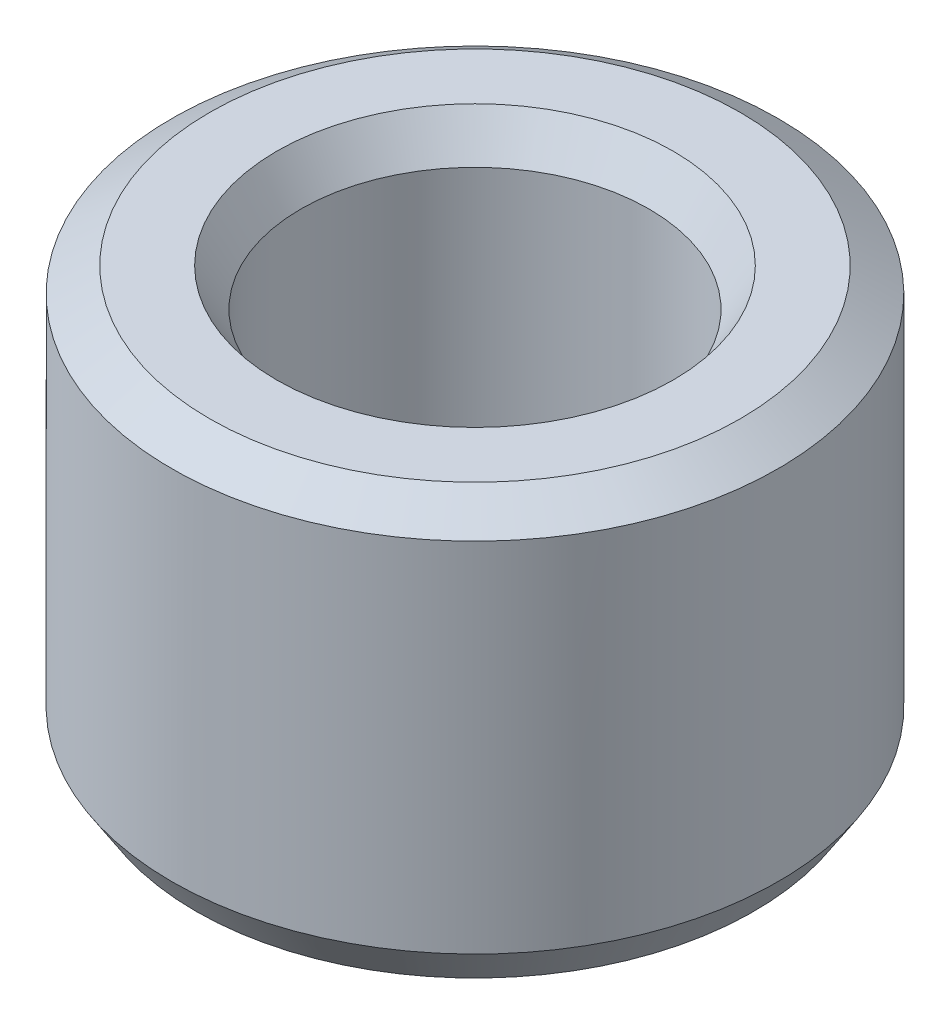
ISO-10303-21;
HEADER;
FILE_DESCRIPTION(('STEP AP214'),'2;1');
FILE_NAME('part.step','',(''),(''),'','','');
FILE_SCHEMA(('AUTOMOTIVE_DESIGN { 1 0 10303 214 1 1 1 1 }'));
ENDSEC;
DATA;
#1=APPLICATION_CONTEXT('core data for automotive mechanical design processes');
#2=APPLICATION_PROTOCOL_DEFINITION('international standard','automotive_design',2000,#1);
#3=PRODUCT_CONTEXT('',#1,'mechanical');
#4=PRODUCT('Part','Part','',(#3));
#5=PRODUCT_RELATED_PRODUCT_CATEGORY('part','',(#4));
#6=PRODUCT_DEFINITION_FORMATION('','',#4);
#7=PRODUCT_DEFINITION_CONTEXT('part definition',#1,'design');
#8=PRODUCT_DEFINITION('design','',#6,#7);
#9=PRODUCT_DEFINITION_SHAPE('','',#8);
#10=(LENGTH_UNIT() NAMED_UNIT(*) SI_UNIT(.MILLI.,.METRE.));
#11=(NAMED_UNIT(*) PLANE_ANGLE_UNIT() SI_UNIT($,.RADIAN.));
#12=(NAMED_UNIT(*) SI_UNIT($,.STERADIAN.) SOLID_ANGLE_UNIT());
#13=UNCERTAINTY_MEASURE_WITH_UNIT(LENGTH_MEASURE(1.E-05),#10,'distance_accuracy_value','');
#14=(GEOMETRIC_REPRESENTATION_CONTEXT(3) GLOBAL_UNCERTAINTY_ASSIGNED_CONTEXT((#13)) GLOBAL_UNIT_ASSIGNED_CONTEXT((#10,
#11,#12)) REPRESENTATION_CONTEXT('',''));
#15=CARTESIAN_POINT('',(0.,0.,0.));
#16=DIRECTION('',(0.,0.,1.));
#17=DIRECTION('',(1.,0.,0.));
#18=AXIS2_PLACEMENT_3D('',#15,#16,#17);
#19=CARTESIAN_POINT('',(0.,51.9072523513595,0.));
#20=DIRECTION('',(0.,-1.,0.));
#21=DIRECTION('',(0.,0.,-1.));
#22=AXIS2_PLACEMENT_3D('',#19,#20,#21);
#23=CYLINDRICAL_SURFACE('',#22,37.5);
#24=CARTESIAN_POINT('',(0.,4.68782630838676,0.));
#25=DIRECTION('',(0.,1.,0.));
#26=DIRECTION('',(0.,0.,1.));
#27=AXIS2_PLACEMENT_3D('',#24,#25,#26);
#28=CIRCLE('',#27,37.5);
#29=CARTESIAN_POINT('',(0.,4.68782630838675,-37.5));
#30=VERTEX_POINT('',#29);
#31=EDGE_CURVE('E10',#30,#30,#28,.T.);
#32=CARTESIAN_POINT('',(0.,48.9088931096387,0.));
#33=DIRECTION('',(0.,1.,0.));
#34=DIRECTION('',(0.,0.,1.));
#35=AXIS2_PLACEMENT_3D('',#32,#33,#34);
#36=CIRCLE('',#35,37.5);
#37=CARTESIAN_POINT('',(0.,48.9088931096387,-37.5));
#38=VERTEX_POINT('',#37);
#39=EDGE_CURVE('E50',#38,#38,#36,.F.);
#40=CARTESIAN_POINT('',(0.,4.68782630838675,-37.5));
#41=CARTESIAN_POINT('',(0.,5.14846242089979,-37.5));
#42=CARTESIAN_POINT('',(0.,5.60909853341283,-37.5));
#43=CARTESIAN_POINT('',(0.,6.53037075843892,-37.5));
#44=CARTESIAN_POINT('',(0.,6.99100687095196,-37.5));
#45=CARTESIAN_POINT('',(0.,7.91227909597804,-37.5));
#46=CARTESIAN_POINT('',(0.,8.37291520849108,-37.5));
#47=CARTESIAN_POINT('',(0.,9.29418743351716,-37.5));
#48=CARTESIAN_POINT('',(0.,9.7548235460302,-37.5));
#49=CARTESIAN_POINT('',(0.,10.6760957710563,-37.5));
#50=CARTESIAN_POINT('',(0.,11.1367318835693,-37.5));
#51=CARTESIAN_POINT('',(0.,12.0580041085954,-37.5));
#52=CARTESIAN_POINT('',(0.,12.5186402211084,-37.5));
#53=CARTESIAN_POINT('',(0.,13.4399124461345,-37.5));
#54=CARTESIAN_POINT('',(0.,13.9005485586476,-37.5));
#55=CARTESIAN_POINT('',(0.,14.8218207836737,-37.5));
#56=CARTESIAN_POINT('',(0.,15.2824568961867,-37.5));
#57=CARTESIAN_POINT('',(0.,16.2037291212128,-37.5));
#58=CARTESIAN_POINT('',(0.,16.6643652337258,-37.5));
#59=CARTESIAN_POINT('',(0.,17.5856374587519,-37.5));
#60=CARTESIAN_POINT('',(0.,18.0462735712649,-37.5));
#61=CARTESIAN_POINT('',(0.,18.967545796291,-37.5));
#62=CARTESIAN_POINT('',(0.,19.4281819088041,-37.5));
#63=CARTESIAN_POINT('',(0.,20.3494541338301,-37.5));
#64=CARTESIAN_POINT('',(0.,20.8100902463432,-37.5));
#65=CARTESIAN_POINT('',(0.,21.7313624713693,-37.5));
#66=CARTESIAN_POINT('',(0.,22.1919985838823,-37.5));
#67=CARTESIAN_POINT('',(0.,23.1132708089084,-37.5));
#68=CARTESIAN_POINT('',(0.,23.5739069214214,-37.5));
#69=CARTESIAN_POINT('',(0.,24.4951791464475,-37.5));
#70=CARTESIAN_POINT('',(0.,24.9558152589605,-37.5));
#71=CARTESIAN_POINT('',(0.,25.8770874839866,-37.5));
#72=CARTESIAN_POINT('',(0.,26.3377235964997,-37.5));
#73=CARTESIAN_POINT('',(0.,27.2589958215258,-37.5));
#74=CARTESIAN_POINT('',(0.,27.7196319340388,-37.5));
#75=CARTESIAN_POINT('',(0.,28.6409041590649,-37.5));
#76=CARTESIAN_POINT('',(0.,29.1015402715779,-37.5));
#77=CARTESIAN_POINT('',(0.,30.022812496604,-37.5));
#78=CARTESIAN_POINT('',(0.,30.483448609117,-37.5));
#79=CARTESIAN_POINT('',(0.,31.4047208341431,-37.5));
#80=CARTESIAN_POINT('',(0.,31.8653569466562,-37.5));
#81=CARTESIAN_POINT('',(0.,32.7866291716823,-37.5));
#82=CARTESIAN_POINT('',(0.,33.2472652841953,-37.5));
#83=CARTESIAN_POINT('',(0.,34.1685375092214,-37.5));
#84=CARTESIAN_POINT('',(0.,34.6291736217344,-37.5));
#85=CARTESIAN_POINT('',(0.,35.5504458467605,-37.5));
#86=CARTESIAN_POINT('',(0.,36.0110819592735,-37.5));
#87=CARTESIAN_POINT('',(0.,36.9323541842996,-37.5));
#88=CARTESIAN_POINT('',(0.,37.3929902968126,-37.5));
#89=CARTESIAN_POINT('',(0.,38.3142625218387,-37.5));
#90=CARTESIAN_POINT('',(0.,38.7748986343518,-37.5));
#91=CARTESIAN_POINT('',(0.,39.6961708593779,-37.5));
#92=CARTESIAN_POINT('',(0.,40.1568069718909,-37.5));
#93=CARTESIAN_POINT('',(0.,41.078079196917,-37.5));
#94=CARTESIAN_POINT('',(0.,41.53871530943,-37.5));
#95=CARTESIAN_POINT('',(0.,42.4599875344561,-37.5));
#96=CARTESIAN_POINT('',(0.,42.9206236469691,-37.5));
#97=CARTESIAN_POINT('',(0.,43.8418958719952,-37.5));
#98=CARTESIAN_POINT('',(0.,44.3025319845083,-37.5));
#99=CARTESIAN_POINT('',(0.,45.2238042095344,-37.5));
#100=CARTESIAN_POINT('',(0.,45.6844403220474,-37.5));
#101=CARTESIAN_POINT('',(0.,46.6057125470735,-37.5));
#102=CARTESIAN_POINT('',(0.,47.0663486595865,-37.5));
#103=CARTESIAN_POINT('',(0.,47.9876208846126,-37.5));
#104=CARTESIAN_POINT('',(0.,48.4482569971256,-37.5));
#105=CARTESIAN_POINT('',(0.,48.9088931096387,-37.5));
#106=B_SPLINE_CURVE_WITH_KNOTS('',3,(#40,#41,#42,#43,#44,#45,#46,#47,#48,#49,#50,#51,#52,#53,
#54,#55,#56,#57,#58,#59,#60,#61,#62,#63,#64,#65,#66,#67,#68,#69,#70,#71,#72,#73,#74,#75,#76,#77,
#78,#79,#80,#81,#82,#83,#84,#85,#86,#87,#88,#89,#90,#91,#92,#93,#94,#95,#96,#97,#98,#99,#100,
#101,#102,#103,#104,#105),.UNSPECIFIED.,.F.,.F.,(4,2,2,2,2,2,2,2,2,2,2,2,2,2,2,2,2,2,2,2,2,2,2,
2,2,2,2,2,2,2,2,2,4),(0.,1.38190833753912,2.76381667507825,4.14572501261737,5.52763335015649,
6.90954168769561,8.29145002523474,9.67335836277386,11.055266700313,12.4371750378521,
13.8190833753912,15.2009917129304,16.5829000504695,17.9648083880086,19.3467167255477,
20.7286250630868,22.110533400626,23.4924417381651,24.8743500757042,26.2562584132433,
27.6381667507825,29.0200750883216,30.4019834258607,31.7838917633998,33.1658001009389,
34.5477084384781,35.9296167760172,37.3115251135563,38.6934334510954,40.0753417886346,
41.4572501261737,42.8391584637128,44.2210668012519),.UNSPECIFIED.);
#107=EDGE_CURVE('BSEAM39',#30,#38,#106,.T.);
#108=ORIENTED_EDGE('',*,*,#31,.T.);
#109=ORIENTED_EDGE('',*,*,#39,.T.);
#110=ORIENTED_EDGE('',*,*,#107,.T.);
#111=ORIENTED_EDGE('',*,*,#107,.F.);
#112=EDGE_LOOP('',(#108,#110,#109,#111));
#113=FACE_BOUND('',#112,.T.);
#114=ADVANCED_FACE('F39',(#113),#23,.T.);
#115=CARTESIAN_POINT('',(0.,51.9072523513595,0.));
#116=DIRECTION('',(0.,1.,0.));
#117=DIRECTION('',(0.,0.,1.));
#118=AXIS2_PLACEMENT_3D('',#115,#116,#117);
#119=PLANE('',#118);
#120=CARTESIAN_POINT('',(0.,51.9072523513595,0.));
#121=DIRECTION('',(0.,1.,0.));
#122=DIRECTION('',(0.,0.,1.));
#123=AXIS2_PLACEMENT_3D('',#120,#121,#122);
#124=CIRCLE('',#123,24.5157571281236);
#125=CARTESIAN_POINT('',(0.,51.9072523513595,24.5157571281236));
#126=VERTEX_POINT('',#125);
#127=EDGE_CURVE('E58',#126,#126,#124,.F.);
#128=ORIENTED_EDGE('',*,*,#127,.T.);
#129=EDGE_LOOP('',(#128));
#130=FACE_BOUND('',#129,.T.);
#131=CARTESIAN_POINT('',(0.,51.9072523513595,0.));
#132=DIRECTION('',(0.,1.,0.));
#133=DIRECTION('',(0.,0.,1.));
#134=AXIS2_PLACEMENT_3D('',#131,#132,#133);
#135=CIRCLE('',#134,32.8121736916135);
#136=CARTESIAN_POINT('',(0.,51.9072523513595,32.8121736916135));
#137=VERTEX_POINT('',#136);
#138=EDGE_CURVE('E61',#137,#137,#135,.T.);
#139=ORIENTED_EDGE('',*,*,#138,.T.);
#140=EDGE_LOOP('',(#139));
#141=FACE_BOUND('',#140,.T.);
#142=ADVANCED_FACE('F88',(#130,#141),#119,.T.);
#143=CARTESIAN_POINT('',(0.,0.,0.));
#144=DIRECTION('',(0.,1.,0.));
#145=DIRECTION('',(0.,0.,1.));
#146=AXIS2_PLACEMENT_3D('',#143,#144,#145);
#147=PLANE('',#146);
#148=CARTESIAN_POINT('',(0.,0.,0.));
#149=DIRECTION('',(0.,1.,0.));
#150=DIRECTION('',(0.,0.,1.));
#151=AXIS2_PLACEMENT_3D('',#148,#149,#150);
#152=CIRCLE('',#151,26.2052241947892);
#153=CARTESIAN_POINT('',(0.,0.,26.2052241947892));
#154=VERTEX_POINT('',#153);
#155=EDGE_CURVE('E51',#154,#154,#152,.T.);
#156=ORIENTED_EDGE('',*,*,#155,.T.);
#157=EDGE_LOOP('',(#156));
#158=FACE_BOUND('',#157,.T.);
#159=CARTESIAN_POINT('',(0.,0.,0.));
#160=DIRECTION('',(0.,1.,0.));
#161=DIRECTION('',(0.,0.,1.));
#162=AXIS2_PLACEMENT_3D('',#159,#160,#161);
#163=CIRCLE('',#162,34.5016407582791);
#164=CARTESIAN_POINT('',(0.,0.,34.5016407582791));
#165=VERTEX_POINT('',#164);
#166=EDGE_CURVE('E54',#165,#165,#163,.F.);
#167=ORIENTED_EDGE('',*,*,#166,.T.);
#168=EDGE_LOOP('',(#167));
#169=FACE_BOUND('',#168,.T.);
#170=ADVANCED_FACE('F83',(#158,#169),#147,.F.);
#171=CARTESIAN_POINT('',(0.,51.9072523513595,0.));
#172=DIRECTION('',(0.,-1.,0.));
#173=DIRECTION('',(0.,0.,-1.));
#174=AXIS2_PLACEMENT_3D('',#171,#172,#173);
#175=CYLINDRICAL_SURFACE('',#174,21.5173978864026);
#176=CARTESIAN_POINT('',(0.,47.2194260429728,0.));
#177=DIRECTION('',(0.,1.,0.));
#178=DIRECTION('',(0.,0.,1.));
#179=AXIS2_PLACEMENT_3D('',#176,#177,#178);
#180=CIRCLE('',#179,21.5173978864026);
#181=CARTESIAN_POINT('',(0.,47.2194260429728,-21.5173978864026));
#182=VERTEX_POINT('',#181);
#183=EDGE_CURVE('E67',#182,#182,#180,.T.);
#184=CARTESIAN_POINT('',(0.,2.99835924172084,0.));
#185=DIRECTION('',(0.,1.,0.));
#186=DIRECTION('',(0.,0.,1.));
#187=AXIS2_PLACEMENT_3D('',#184,#185,#186);
#188=CIRCLE('',#187,21.5173978864026);
#189=CARTESIAN_POINT('',(0.,2.99835924172084,-21.5173978864026));
#190=VERTEX_POINT('',#189);
#191=EDGE_CURVE('E69',#190,#190,#188,.F.);
#192=CARTESIAN_POINT('',(0.,47.2194260429728,-21.5173978864026));
#193=CARTESIAN_POINT('',(0.,46.7587899304597,-21.5173978864026));
#194=CARTESIAN_POINT('',(0.,46.2981538179467,-21.5173978864026));
#195=CARTESIAN_POINT('',(0.,45.3768815929206,-21.5173978864026));
#196=CARTESIAN_POINT('',(0.,44.9162454804076,-21.5173978864026));
#197=CARTESIAN_POINT('',(0.,43.9949732553815,-21.5173978864026));
#198=CARTESIAN_POINT('',(0.,43.5343371428684,-21.5173978864026));
#199=CARTESIAN_POINT('',(0.,42.6130649178424,-21.5173978864026));
#200=CARTESIAN_POINT('',(0.,42.1524288053293,-21.5173978864026));
#201=CARTESIAN_POINT('',(0.,41.2311565803032,-21.5173978864026));
#202=CARTESIAN_POINT('',(0.,40.7705204677902,-21.5173978864026));
#203=CARTESIAN_POINT('',(0.,39.8492482427641,-21.5173978864026));
#204=CARTESIAN_POINT('',(0.,39.3886121302511,-21.5173978864026));
#205=CARTESIAN_POINT('',(0.,38.467339905225,-21.5173978864026));
#206=CARTESIAN_POINT('',(0.,38.006703792712,-21.5173978864026));
#207=CARTESIAN_POINT('',(0.,37.0854315676859,-21.5173978864026));
#208=CARTESIAN_POINT('',(0.,36.6247954551728,-21.5173978864026));
#209=CARTESIAN_POINT('',(0.,35.7035232301468,-21.5173978864026));
#210=CARTESIAN_POINT('',(0.,35.2428871176337,-21.5173978864026));
#211=CARTESIAN_POINT('',(0.,34.3216148926076,-21.5173978864026));
#212=CARTESIAN_POINT('',(0.,33.8609787800946,-21.5173978864026));
#213=CARTESIAN_POINT('',(0.,32.9397065550685,-21.5173978864026));
#214=CARTESIAN_POINT('',(0.,32.4790704425555,-21.5173978864026));
#215=CARTESIAN_POINT('',(0.,31.5577982175294,-21.5173978864026));
#216=CARTESIAN_POINT('',(0.,31.0971621050163,-21.5173978864026));
#217=CARTESIAN_POINT('',(0.,30.1758898799903,-21.5173978864026));
#218=CARTESIAN_POINT('',(0.,29.7152537674772,-21.5173978864026));
#219=CARTESIAN_POINT('',(0.,28.7939815424511,-21.5173978864026));
#220=CARTESIAN_POINT('',(0.,28.3333454299381,-21.5173978864026));
#221=CARTESIAN_POINT('',(0.,27.412073204912,-21.5173978864026));
#222=CARTESIAN_POINT('',(0.,26.951437092399,-21.5173978864026));
#223=CARTESIAN_POINT('',(0.,26.0301648673729,-21.5173978864026));
#224=CARTESIAN_POINT('',(0.,25.5695287548598,-21.5173978864026));
#225=CARTESIAN_POINT('',(0.,24.6482565298338,-21.5173978864026));
#226=CARTESIAN_POINT('',(0.,24.1876204173207,-21.5173978864026));
#227=CARTESIAN_POINT('',(0.,23.2663481922946,-21.5173978864026));
#228=CARTESIAN_POINT('',(0.,22.8057120797816,-21.5173978864026));
#229=CARTESIAN_POINT('',(0.,21.8844398547555,-21.5173978864026));
#230=CARTESIAN_POINT('',(0.,21.4238037422425,-21.5173978864026));
#231=CARTESIAN_POINT('',(0.,20.5025315172164,-21.5173978864026));
#232=CARTESIAN_POINT('',(0.,20.0418954047034,-21.5173978864026));
#233=CARTESIAN_POINT('',(0.,19.1206231796773,-21.5173978864026));
#234=CARTESIAN_POINT('',(0.,18.6599870671642,-21.5173978864026));
#235=CARTESIAN_POINT('',(0.,17.7387148421382,-21.5173978864026));
#236=CARTESIAN_POINT('',(0.,17.2780787296251,-21.5173978864026));
#237=CARTESIAN_POINT('',(0.,16.356806504599,-21.5173978864026));
#238=CARTESIAN_POINT('',(0.,15.896170392086,-21.5173978864026));
#239=CARTESIAN_POINT('',(0.,14.9748981670599,-21.5173978864026));
#240=CARTESIAN_POINT('',(0.,14.5142620545469,-21.5173978864026));
#241=CARTESIAN_POINT('',(0.,13.5929898295208,-21.5173978864026));
#242=CARTESIAN_POINT('',(0.,13.1323537170077,-21.5173978864026));
#243=CARTESIAN_POINT('',(0.,12.2110814919817,-21.5173978864026));
#244=CARTESIAN_POINT('',(0.,11.7504453794686,-21.5173978864026));
#245=CARTESIAN_POINT('',(0.,10.8291731544425,-21.5173978864026));
#246=CARTESIAN_POINT('',(0.,10.3685370419295,-21.5173978864026));
#247=CARTESIAN_POINT('',(0.,9.44726481690342,-21.5173978864026));
#248=CARTESIAN_POINT('',(0.,8.98662870439038,-21.5173978864026));
#249=CARTESIAN_POINT('',(0.,8.06535647936429,-21.5173978864026));
#250=CARTESIAN_POINT('',(0.,7.60472036685125,-21.5173978864026));
#251=CARTESIAN_POINT('',(0.,6.68344814182517,-21.5173978864026));
#252=CARTESIAN_POINT('',(0.,6.22281202931213,-21.5173978864026));
#253=CARTESIAN_POINT('',(0.,5.30153980428605,-21.5173978864026));
#254=CARTESIAN_POINT('',(0.,4.84090369177301,-21.5173978864026));
#255=CARTESIAN_POINT('',(0.,3.91963146674693,-21.5173978864026));
#256=CARTESIAN_POINT('',(0.,3.45899535423389,-21.5173978864026));
#257=CARTESIAN_POINT('',(0.,2.99835924172084,-21.5173978864026));
#258=B_SPLINE_CURVE_WITH_KNOTS('',3,(#192,#193,#194,#195,#196,#197,#198,#199,#200,#201,#202,
#203,#204,#205,#206,#207,#208,#209,#210,#211,#212,#213,#214,#215,#216,#217,#218,#219,#220,#221,
#222,#223,#224,#225,#226,#227,#228,#229,#230,#231,#232,#233,#234,#235,#236,#237,#238,#239,#240,
#241,#242,#243,#244,#245,#246,#247,#248,#249,#250,#251,#252,#253,#254,#255,#256,#257),
.UNSPECIFIED.,.F.,.F.,(4,2,2,2,2,2,2,2,2,2,2,2,2,2,2,2,2,2,2,2,2,2,2,2,2,2,2,2,2,2,2,2,4),(0.,
1.38190833753912,2.76381667507825,4.14572501261736,5.52763335015648,6.90954168769561,
8.29145002523473,9.67335836277385,11.055266700313,12.4371750378521,13.8190833753912,
15.2009917129303,16.5829000504695,17.9648083880086,19.3467167255477,20.7286250630868,
22.110533400626,23.4924417381651,24.8743500757042,26.2562584132433,27.6381667507824,
29.0200750883216,30.4019834258607,31.7838917633998,33.1658001009389,34.5477084384781,
35.9296167760172,37.3115251135563,38.6934334510954,40.0753417886346,41.4572501261737,
42.8391584637128,44.2210668012519),.UNSPECIFIED.);
#259=EDGE_CURVE('BSEAM71',#182,#190,#258,.T.);
#260=ORIENTED_EDGE('',*,*,#183,.T.);
#261=ORIENTED_EDGE('',*,*,#191,.T.);
#262=ORIENTED_EDGE('',*,*,#259,.T.);
#263=ORIENTED_EDGE('',*,*,#259,.F.);
#264=EDGE_LOOP('',(#260,#262,#261,#263));
#265=FACE_BOUND('',#264,.T.);
#266=ADVANCED_FACE('F71',(#265),#175,.F.);
#267=CARTESIAN_POINT('',(0.,47.2194260429728,0.));
#268=DIRECTION('',(0.,1.,0.));
#269=DIRECTION('',(0.,0.,1.));
#270=AXIS2_PLACEMENT_3D('',#267,#268,#269);
#271=CONICAL_SURFACE('',#270,21.5173978864026,0.569033236772591);
#272=ORIENTED_EDGE('',*,*,#127,.F.);
#273=EDGE_LOOP('',(#272));
#274=FACE_BOUND('',#273,.T.);
#275=ORIENTED_EDGE('',*,*,#183,.F.);
#276=EDGE_LOOP('',(#275));
#277=FACE_BOUND('',#276,.T.);
#278=ADVANCED_FACE('F77',(#274,#277),#271,.F.);
#279=CARTESIAN_POINT('',(0.,0.,0.));
#280=DIRECTION('',(0.,-1.,0.));
#281=DIRECTION('',(0.,0.,-1.));
#282=AXIS2_PLACEMENT_3D('',#279,#280,#281);
#283=CONICAL_SURFACE('',#282,26.2052241947892,1.0017630900223);
#284=ORIENTED_EDGE('',*,*,#191,.F.);
#285=EDGE_LOOP('',(#284));
#286=FACE_BOUND('',#285,.T.);
#287=ORIENTED_EDGE('',*,*,#155,.F.);
#288=EDGE_LOOP('',(#287));
#289=FACE_BOUND('',#288,.T.);
#290=ADVANCED_FACE('F73',(#286,#289),#283,.F.);
#291=CARTESIAN_POINT('',(0.,4.68782630838676,0.));
#292=DIRECTION('',(0.,1.,0.));
#293=DIRECTION('',(0.,0.,1.));
#294=AXIS2_PLACEMENT_3D('',#291,#292,#293);
#295=CONICAL_SURFACE('',#294,37.5,0.56903323677259);
#296=ORIENTED_EDGE('',*,*,#166,.F.);
#297=EDGE_LOOP('',(#296));
#298=FACE_BOUND('',#297,.T.);
#299=ORIENTED_EDGE('',*,*,#31,.F.);
#300=EDGE_LOOP('',(#299));
#301=FACE_BOUND('',#300,.T.);
#302=ADVANCED_FACE('F76',(#298,#301),#295,.T.);
#303=CARTESIAN_POINT('',(0.,51.9072523513595,0.));
#304=DIRECTION('',(0.,-1.,0.));
#305=DIRECTION('',(0.,0.,-1.));
#306=AXIS2_PLACEMENT_3D('',#303,#304,#305);
#307=CONICAL_SURFACE('',#306,32.8121736916135,1.0017630900223);
#308=ORIENTED_EDGE('',*,*,#39,.F.);
#309=EDGE_LOOP('',(#308));
#310=FACE_BOUND('',#309,.T.);
#311=ORIENTED_EDGE('',*,*,#138,.F.);
#312=EDGE_LOOP('',(#311));
#313=FACE_BOUND('',#312,.T.);
#314=ADVANCED_FACE('F45',(#310,#313),#307,.T.);
#315=CLOSED_SHELL('',(#114,#142,#170,#266,#278,#290,#302,#314));
#316=MANIFOLD_SOLID_BREP('B2',#315);
#317=ADVANCED_BREP_SHAPE_REPRESENTATION('',(#18,#316),#14);
#318=SHAPE_DEFINITION_REPRESENTATION(#9,#317);
ENDSEC;
END-ISO-10303-21;
